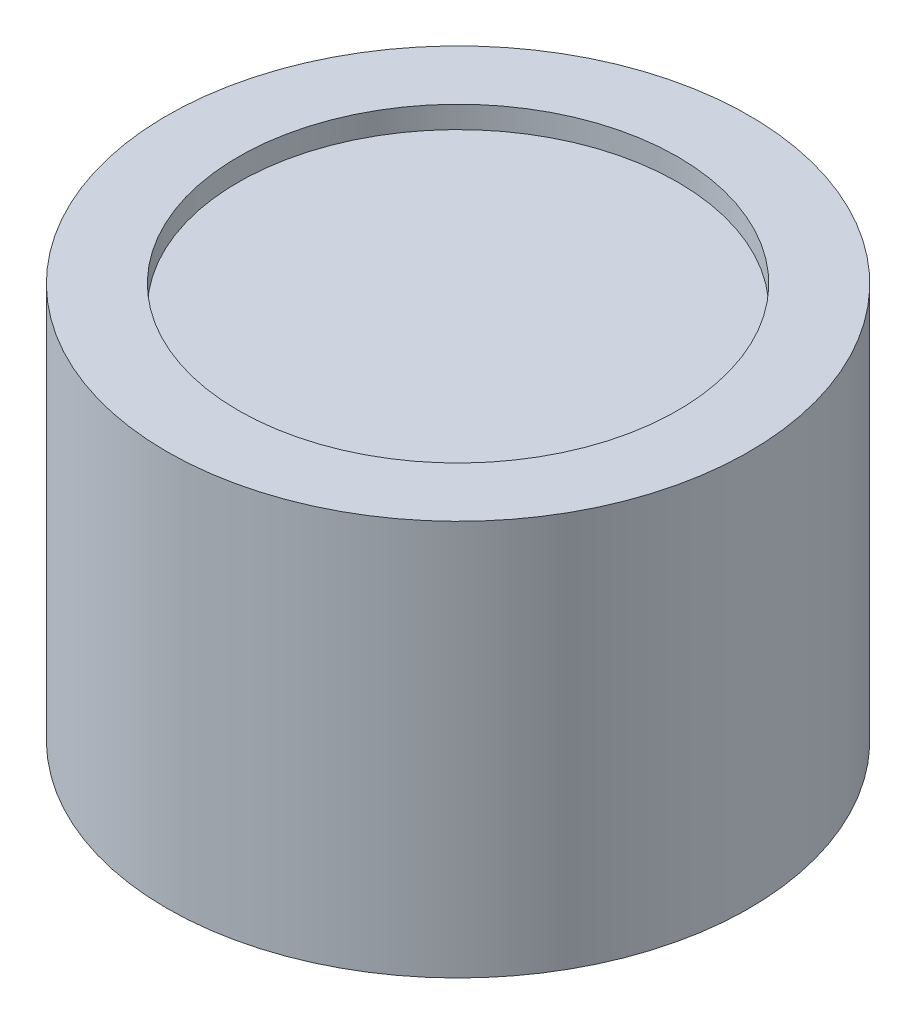
ISO-10303-21;
HEADER;
FILE_DESCRIPTION(('STEP AP214'),'2;1');
FILE_NAME('part.step','',(''),(''),'','','');
FILE_SCHEMA(('AUTOMOTIVE_DESIGN { 1 0 10303 214 1 1 1 1 }'));
ENDSEC;
DATA;
#1=APPLICATION_CONTEXT('core data for automotive mechanical design processes');
#2=APPLICATION_PROTOCOL_DEFINITION('international standard','automotive_design',2000,#1);
#3=PRODUCT_CONTEXT('',#1,'mechanical');
#4=PRODUCT('Part','Part','',(#3));
#5=PRODUCT_RELATED_PRODUCT_CATEGORY('part','',(#4));
#6=PRODUCT_DEFINITION_FORMATION('','',#4);
#7=PRODUCT_DEFINITION_CONTEXT('part definition',#1,'design');
#8=PRODUCT_DEFINITION('design','',#6,#7);
#9=PRODUCT_DEFINITION_SHAPE('','',#8);
#10=(LENGTH_UNIT() NAMED_UNIT(*) SI_UNIT(.MILLI.,.METRE.));
#11=(NAMED_UNIT(*) PLANE_ANGLE_UNIT() SI_UNIT($,.RADIAN.));
#12=(NAMED_UNIT(*) SI_UNIT($,.STERADIAN.) SOLID_ANGLE_UNIT());
#13=UNCERTAINTY_MEASURE_WITH_UNIT(LENGTH_MEASURE(1.E-05),#10,'distance_accuracy_value','');
#14=(GEOMETRIC_REPRESENTATION_CONTEXT(3) GLOBAL_UNCERTAINTY_ASSIGNED_CONTEXT((#13)) GLOBAL_UNIT_ASSIGNED_CONTEXT((#10,
#11,#12)) REPRESENTATION_CONTEXT('',''));
#15=CARTESIAN_POINT('',(0.,0.,0.));
#16=DIRECTION('',(0.,0.,1.));
#17=DIRECTION('',(1.,0.,0.));
#18=AXIS2_PLACEMENT_3D('',#15,#16,#17);
#19=CARTESIAN_POINT('',(0.,35.,0.));
#20=DIRECTION('',(0.,-1.,0.));
#21=DIRECTION('',(0.,0.,-1.));
#22=AXIS2_PLACEMENT_3D('',#19,#20,#21);
#23=CYLINDRICAL_SURFACE('',#22,13.25);
#24=CARTESIAN_POINT('',(0.,0.,0.));
#25=DIRECTION('',(0.,1.,0.));
#26=DIRECTION('',(0.,0.,1.));
#27=AXIS2_PLACEMENT_3D('',#24,#25,#26);
#28=CIRCLE('',#27,13.25);
#29=CARTESIAN_POINT('',(0.,0.,13.25));
#30=VERTEX_POINT('',#29);
#31=EDGE_CURVE('E11',#30,#30,#28,.T.);
#32=ORIENTED_EDGE('',*,*,#31,.T.);
#33=EDGE_LOOP('',(#32));
#34=FACE_BOUND('',#33,.T.);
#35=CARTESIAN_POINT('',(0.,18.,0.));
#36=DIRECTION('',(0.,1.,0.));
#37=DIRECTION('',(0.,0.,1.));
#38=AXIS2_PLACEMENT_3D('',#35,#36,#37);
#39=CIRCLE('',#38,13.25);
#40=CARTESIAN_POINT('',(0.,18.,13.25));
#41=VERTEX_POINT('',#40);
#42=EDGE_CURVE('E124',#41,#41,#39,.T.);
#43=ORIENTED_EDGE('',*,*,#42,.F.);
#44=EDGE_LOOP('',(#43));
#45=FACE_BOUND('',#44,.T.);
#46=ADVANCED_FACE('F42',(#34,#45),#23,.T.);
#47=CARTESIAN_POINT('',(0.,0.,0.));
#48=DIRECTION('',(0.,1.,0.));
#49=DIRECTION('',(0.,0.,1.));
#50=AXIS2_PLACEMENT_3D('',#47,#48,#49);
#51=PLANE('',#50);
#52=CARTESIAN_POINT('',(0.,0.,0.));
#53=DIRECTION('',(0.,-1.,0.));
#54=DIRECTION('',(0.,0.,-1.));
#55=AXIS2_PLACEMENT_3D('',#52,#53,#54);
#56=CIRCLE('',#55,10.);
#57=CARTESIAN_POINT('',(0.,0.,-10.));
#58=VERTEX_POINT('',#57);
#59=EDGE_CURVE('E102',#58,#58,#56,.T.);
#60=ORIENTED_EDGE('',*,*,#59,.F.);
#61=EDGE_LOOP('',(#60));
#62=FACE_BOUND('',#61,.T.);
#63=ORIENTED_EDGE('',*,*,#31,.F.);
#64=EDGE_LOOP('',(#63));
#65=FACE_BOUND('',#64,.T.);
#66=ADVANCED_FACE('F115',(#62,#65),#51,.F.);
#67=CARTESIAN_POINT('',(0.,8.,0.));
#68=DIRECTION('',(0.,-1.,0.));
#69=DIRECTION('',(0.,0.,-1.));
#70=AXIS2_PLACEMENT_3D('',#67,#68,#69);
#71=CYLINDRICAL_SURFACE('',#70,10.);
#72=CARTESIAN_POINT('',(0.,8.,0.));
#73=DIRECTION('',(0.,-1.,0.));
#74=DIRECTION('',(0.,0.,-1.));
#75=AXIS2_PLACEMENT_3D('',#72,#73,#74);
#76=CIRCLE('',#75,10.);
#77=CARTESIAN_POINT('',(0.,8.,-10.));
#78=VERTEX_POINT('',#77);
#79=EDGE_CURVE('E51',#78,#78,#76,.T.);
#80=ORIENTED_EDGE('',*,*,#79,.F.);
#81=EDGE_LOOP('',(#80));
#82=FACE_BOUND('',#81,.T.);
#83=ORIENTED_EDGE('',*,*,#59,.T.);
#84=EDGE_LOOP('',(#83));
#85=FACE_BOUND('',#84,.T.);
#86=ADVANCED_FACE('F113',(#82,#85),#71,.F.);
#87=CARTESIAN_POINT('',(0.,8.,0.));
#88=DIRECTION('',(0.,-1.,0.));
#89=DIRECTION('',(0.,0.,-1.));
#90=AXIS2_PLACEMENT_3D('',#87,#88,#89);
#91=PLANE('',#90);
#92=CARTESIAN_POINT('',(0.,8.,0.));
#93=DIRECTION('',(0.,-1.,0.));
#94=DIRECTION('',(0.,0.,-1.));
#95=AXIS2_PLACEMENT_3D('',#92,#93,#94);
#96=CIRCLE('',#95,3.48500000000002);
#97=CARTESIAN_POINT('',(0.,8.,-3.48500000000002));
#98=VERTEX_POINT('',#97);
#99=EDGE_CURVE('E75',#98,#98,#96,.T.);
#100=ORIENTED_EDGE('',*,*,#99,.F.);
#101=EDGE_LOOP('',(#100));
#102=FACE_BOUND('',#101,.T.);
#103=ORIENTED_EDGE('',*,*,#79,.T.);
#104=EDGE_LOOP('',(#103));
#105=FACE_BOUND('',#104,.T.);
#106=ADVANCED_FACE('F155',(#102,#105),#91,.T.);
#107=CARTESIAN_POINT('',(0.,4.,0.));
#108=DIRECTION('',(0.,1.,0.));
#109=DIRECTION('',(0.,0.,1.));
#110=AXIS2_PLACEMENT_3D('',#107,#108,#109);
#111=CYLINDRICAL_SURFACE('',#110,3.48500000000002);
#112=CARTESIAN_POINT('',(0.,4.,0.));
#113=DIRECTION('',(0.,-1.,0.));
#114=DIRECTION('',(0.,0.,-1.));
#115=AXIS2_PLACEMENT_3D('',#112,#113,#114);
#116=CIRCLE('',#115,3.48500000000002);
#117=CARTESIAN_POINT('',(0.,4.,-3.48500000000002));
#118=VERTEX_POINT('',#117);
#119=EDGE_CURVE('E98',#118,#118,#116,.T.);
#120=ORIENTED_EDGE('',*,*,#119,.F.);
#121=EDGE_LOOP('',(#120));
#122=FACE_BOUND('',#121,.T.);
#123=ORIENTED_EDGE('',*,*,#99,.T.);
#124=EDGE_LOOP('',(#123));
#125=FACE_BOUND('',#124,.T.);
#126=ADVANCED_FACE('F152',(#122,#125),#111,.T.);
#127=CARTESIAN_POINT('',(0.,4.,0.));
#128=DIRECTION('',(0.,-1.,0.));
#129=DIRECTION('',(0.,0.,-1.));
#130=AXIS2_PLACEMENT_3D('',#127,#128,#129);
#131=PLANE('',#130);
#132=CARTESIAN_POINT('',(0.,4.,0.));
#133=DIRECTION('',(0.,-1.,0.));
#134=DIRECTION('',(0.,0.,-1.));
#135=AXIS2_PLACEMENT_3D('',#132,#133,#134);
#136=CIRCLE('',#135,1.61652830439528);
#137=CARTESIAN_POINT('',(1.12399048860633,4.,-1.16181286807884));
#138=VERTEX_POINT('',#137);
#139=CARTESIAN_POINT('',(-1.12399048860633,4.,-1.16181286807884));
#140=VERTEX_POINT('',#139);
#141=EDGE_CURVE('E58',#138,#140,#136,.T.);
#142=ORIENTED_EDGE('',*,*,#141,.F.);
#143=DIRECTION('',(1.,0.,0.));
#144=VECTOR('',#143,1.);
#145=CARTESIAN_POINT('',(1.12399048860633,4.,-1.16181286807884));
#146=LINE('',#145,#144);
#147=EDGE_CURVE('E79',#140,#138,#146,.T.);
#148=ORIENTED_EDGE('',*,*,#147,.F.);
#149=EDGE_LOOP('',(#142,#148));
#150=FACE_BOUND('',#149,.T.);
#151=ORIENTED_EDGE('',*,*,#119,.T.);
#152=EDGE_LOOP('',(#151));
#153=FACE_BOUND('',#152,.T.);
#154=ADVANCED_FACE('F84',(#150,#153),#131,.T.);
#155=CARTESIAN_POINT('',(0.,12.75,0.));
#156=DIRECTION('',(0.,-1.,0.));
#157=DIRECTION('',(0.,0.,-1.));
#158=AXIS2_PLACEMENT_3D('',#155,#156,#157);
#159=CYLINDRICAL_SURFACE('',#158,1.61652830439528);
#160=ORIENTED_EDGE('',*,*,#141,.T.);
#161=DIRECTION('',(0.,-1.,0.));
#162=VECTOR('',#161,1.);
#163=CARTESIAN_POINT('',(-1.12399048860633,12.75,-1.16181286807884));
#164=LINE('',#163,#162);
#165=CARTESIAN_POINT('',(-1.12399048860633,12.75,-1.16181286807884));
#166=VERTEX_POINT('',#165);
#167=EDGE_CURVE('E76',#166,#140,#164,.T.);
#168=ORIENTED_EDGE('',*,*,#167,.F.);
#169=CARTESIAN_POINT('',(0.,12.75,0.));
#170=DIRECTION('',(0.,-1.,0.));
#171=DIRECTION('',(0.,0.,-1.));
#172=AXIS2_PLACEMENT_3D('',#169,#170,#171);
#173=CIRCLE('',#172,1.61652830439528);
#174=CARTESIAN_POINT('',(1.12399048860633,12.75,-1.16181286807884));
#175=VERTEX_POINT('',#174);
#176=EDGE_CURVE('E72',#175,#166,#173,.T.);
#177=ORIENTED_EDGE('',*,*,#176,.F.);
#178=DIRECTION('',(0.,-1.,0.));
#179=VECTOR('',#178,1.);
#180=CARTESIAN_POINT('',(1.12399048860633,12.75,-1.16181286807884));
#181=LINE('',#180,#179);
#182=EDGE_CURVE('E66',#175,#138,#181,.T.);
#183=ORIENTED_EDGE('',*,*,#182,.T.);
#184=EDGE_LOOP('',(#160,#168,#177,#183));
#185=FACE_BOUND('',#184,.T.);
#186=ADVANCED_FACE('F70',(#185),#159,.F.);
#187=CARTESIAN_POINT('',(1.12399048860633,12.75,-1.16181286807884));
#188=DIRECTION('',(0.,0.,-1.));
#189=DIRECTION('',(-1.,0.,0.));
#190=AXIS2_PLACEMENT_3D('',#187,#188,#189);
#191=PLANE('',#190);
#192=ORIENTED_EDGE('',*,*,#147,.T.);
#193=ORIENTED_EDGE('',*,*,#182,.F.);
#194=DIRECTION('',(1.,0.,0.));
#195=VECTOR('',#194,1.);
#196=CARTESIAN_POINT('',(1.12399048860633,12.75,-1.16181286807884));
#197=LINE('',#196,#195);
#198=EDGE_CURVE('E93',#166,#175,#197,.T.);
#199=ORIENTED_EDGE('',*,*,#198,.F.);
#200=ORIENTED_EDGE('',*,*,#167,.T.);
#201=EDGE_LOOP('',(#192,#193,#199,#200));
#202=FACE_BOUND('',#201,.T.);
#203=ADVANCED_FACE('F80',(#202),#191,.F.);
#204=CARTESIAN_POINT('',(0.,12.75,0.));
#205=DIRECTION('',(0.,-1.,0.));
#206=DIRECTION('',(0.,0.,-1.));
#207=AXIS2_PLACEMENT_3D('',#204,#205,#206);
#208=PLANE('',#207);
#209=ORIENTED_EDGE('',*,*,#176,.T.);
#210=ORIENTED_EDGE('',*,*,#198,.T.);
#211=EDGE_LOOP('',(#209,#210));
#212=FACE_BOUND('',#211,.T.);
#213=ADVANCED_FACE('F133',(#212),#208,.T.);
#214=CARTESIAN_POINT('',(0.,18.,0.));
#215=DIRECTION('',(0.,1.,0.));
#216=DIRECTION('',(0.,0.,1.));
#217=AXIS2_PLACEMENT_3D('',#214,#215,#216);
#218=PLANE('',#217);
#219=ORIENTED_EDGE('',*,*,#42,.T.);
#220=EDGE_LOOP('',(#219));
#221=FACE_BOUND('',#220,.T.);
#222=CARTESIAN_POINT('',(0.,18.,0.));
#223=DIRECTION('',(0.,1.,0.));
#224=DIRECTION('',(0.,0.,1.));
#225=AXIS2_PLACEMENT_3D('',#222,#223,#224);
#226=CIRCLE('',#225,10.);
#227=CARTESIAN_POINT('',(0.,18.,10.));
#228=VERTEX_POINT('',#227);
#229=EDGE_CURVE('E45',#228,#228,#226,.F.);
#230=ORIENTED_EDGE('',*,*,#229,.T.);
#231=EDGE_LOOP('',(#230));
#232=FACE_BOUND('',#231,.T.);
#233=ADVANCED_FACE('F135',(#221,#232),#218,.T.);
#234=CARTESIAN_POINT('',(0.,17.,0.));
#235=DIRECTION('',(0.,1.,0.));
#236=DIRECTION('',(0.,0.,1.));
#237=AXIS2_PLACEMENT_3D('',#234,#235,#236);
#238=PLANE('',#237);
#239=CARTESIAN_POINT('',(0.,17.,0.));
#240=DIRECTION('',(0.,1.,0.));
#241=DIRECTION('',(0.,0.,1.));
#242=AXIS2_PLACEMENT_3D('',#239,#240,#241);
#243=CIRCLE('',#242,10.);
#244=CARTESIAN_POINT('',(0.,17.,10.));
#245=VERTEX_POINT('',#244);
#246=EDGE_CURVE('E87',#245,#245,#243,.T.);
#247=ORIENTED_EDGE('',*,*,#246,.T.);
#248=EDGE_LOOP('',(#247));
#249=FACE_BOUND('',#248,.T.);
#250=ADVANCED_FACE('F141',(#249),#238,.T.);
#251=CARTESIAN_POINT('',(0.,17.,0.));
#252=DIRECTION('',(0.,1.,0.));
#253=DIRECTION('',(0.,0.,1.));
#254=AXIS2_PLACEMENT_3D('',#251,#252,#253);
#255=CYLINDRICAL_SURFACE('',#254,10.);
#256=ORIENTED_EDGE('',*,*,#246,.F.);
#257=EDGE_LOOP('',(#256));
#258=FACE_BOUND('',#257,.T.);
#259=ORIENTED_EDGE('',*,*,#229,.F.);
#260=EDGE_LOOP('',(#259));
#261=FACE_BOUND('',#260,.T.);
#262=ADVANCED_FACE('F145',(#258,#261),#255,.F.);
#263=CLOSED_SHELL('',(#46,#66,#86,#106,#126,#154,#186,#203,#213,#233,#250,#262));
#264=MANIFOLD_SOLID_BREP('B2',#263);
#265=ADVANCED_BREP_SHAPE_REPRESENTATION('',(#18,#264),#14);
#266=SHAPE_DEFINITION_REPRESENTATION(#9,#265);
ENDSEC;
END-ISO-10303-21;
